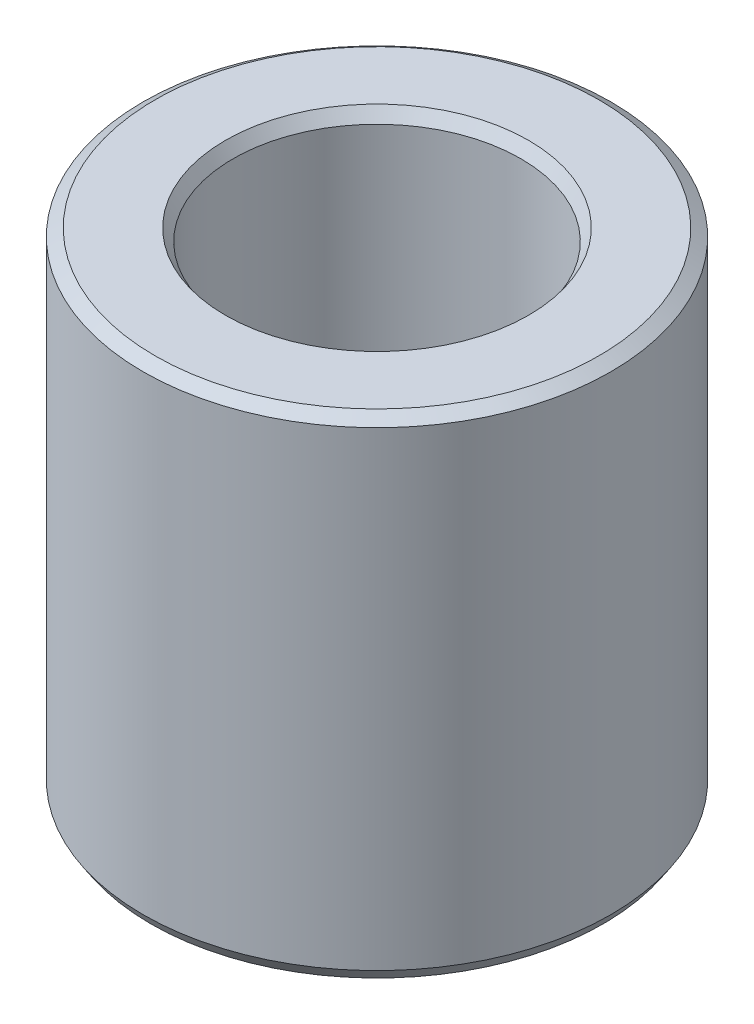
ISO-10303-21;
HEADER;
FILE_DESCRIPTION(('STEP AP214'),'2;1');
FILE_NAME('part.step','',(''),(''),'','','');
FILE_SCHEMA(('AUTOMOTIVE_DESIGN { 1 0 10303 214 1 1 1 1 }'));
ENDSEC;
DATA;
#1=APPLICATION_CONTEXT('core data for automotive mechanical design processes');
#2=APPLICATION_PROTOCOL_DEFINITION('international standard','automotive_design',2000,#1);
#3=PRODUCT_CONTEXT('',#1,'mechanical');
#4=PRODUCT('Part','Part','',(#3));
#5=PRODUCT_RELATED_PRODUCT_CATEGORY('part','',(#4));
#6=PRODUCT_DEFINITION_FORMATION('','',#4);
#7=PRODUCT_DEFINITION_CONTEXT('part definition',#1,'design');
#8=PRODUCT_DEFINITION('design','',#6,#7);
#9=PRODUCT_DEFINITION_SHAPE('','',#8);
#10=(LENGTH_UNIT() NAMED_UNIT(*) SI_UNIT(.MILLI.,.METRE.));
#11=(NAMED_UNIT(*) PLANE_ANGLE_UNIT() SI_UNIT($,.RADIAN.));
#12=(NAMED_UNIT(*) SI_UNIT($,.STERADIAN.) SOLID_ANGLE_UNIT());
#13=UNCERTAINTY_MEASURE_WITH_UNIT(LENGTH_MEASURE(1.E-05),#10,'distance_accuracy_value','');
#14=(GEOMETRIC_REPRESENTATION_CONTEXT(3) GLOBAL_UNCERTAINTY_ASSIGNED_CONTEXT((#13)) GLOBAL_UNIT_ASSIGNED_CONTEXT((#10,
#11,#12)) REPRESENTATION_CONTEXT('',''));
#15=CARTESIAN_POINT('',(0.,0.,0.));
#16=DIRECTION('',(0.,0.,1.));
#17=DIRECTION('',(1.,0.,0.));
#18=AXIS2_PLACEMENT_3D('',#15,#16,#17);
#19=CARTESIAN_POINT('',(0.,120.466555208747,0.));
#20=DIRECTION('',(0.,-1.,0.));
#21=DIRECTION('',(0.,0.,-1.));
#22=AXIS2_PLACEMENT_3D('',#19,#20,#21);
#23=CYLINDRICAL_SURFACE('',#22,57.5);
#24=CARTESIAN_POINT('',(0.,2.94270009944182,0.));
#25=DIRECTION('',(0.,1.,0.));
#26=DIRECTION('',(0.,0.,1.));
#27=AXIS2_PLACEMENT_3D('',#24,#25,#26);
#28=CIRCLE('',#27,57.5);
#29=CARTESIAN_POINT('',(0.,2.94270009944181,-57.5));
#30=VERTEX_POINT('',#29);
#31=EDGE_CURVE('E10',#30,#30,#28,.T.);
#32=CARTESIAN_POINT('',(0.,118.551658576168,0.));
#33=DIRECTION('',(0.,1.,0.));
#34=DIRECTION('',(0.,0.,1.));
#35=AXIS2_PLACEMENT_3D('',#32,#33,#34);
#36=CIRCLE('',#35,57.5);
#37=CARTESIAN_POINT('',(0.,118.551658576168,-57.5));
#38=VERTEX_POINT('',#37);
#39=EDGE_CURVE('E50',#38,#38,#36,.F.);
#40=CARTESIAN_POINT('',(0.,2.94270009944181,-57.5));
#41=CARTESIAN_POINT('',(0.,4.14696008357438,-57.5));
#42=CARTESIAN_POINT('',(0.,5.35122006770694,-57.5));
#43=CARTESIAN_POINT('',(0.,7.75974003597207,-57.5));
#44=CARTESIAN_POINT('',(0.,8.96400002010464,-57.5));
#45=CARTESIAN_POINT('',(0.,11.3725199883698,-57.5));
#46=CARTESIAN_POINT('',(0.,12.5767799725023,-57.5));
#47=CARTESIAN_POINT('',(0.,14.9852999407675,-57.5));
#48=CARTESIAN_POINT('',(0.,16.1895599249,-57.5));
#49=CARTESIAN_POINT('',(0.,18.5980798931652,-57.5));
#50=CARTESIAN_POINT('',(0.,19.8023398772977,-57.5));
#51=CARTESIAN_POINT('',(0.,22.2108598455629,-57.5));
#52=CARTESIAN_POINT('',(0.,23.4151198296954,-57.5));
#53=CARTESIAN_POINT('',(0.,25.8236397979606,-57.5));
#54=CARTESIAN_POINT('',(0.,27.0278997820931,-57.5));
#55=CARTESIAN_POINT('',(0.,29.4364197503583,-57.5));
#56=CARTESIAN_POINT('',(0.,30.6406797344908,-57.5));
#57=CARTESIAN_POINT('',(0.,33.049199702756,-57.5));
#58=CARTESIAN_POINT('',(0.,34.2534596868885,-57.5));
#59=CARTESIAN_POINT('',(0.,36.6619796551537,-57.5));
#60=CARTESIAN_POINT('',(0.,37.8662396392862,-57.5));
#61=CARTESIAN_POINT('',(0.,40.2747596075514,-57.5));
#62=CARTESIAN_POINT('',(0.,41.4790195916839,-57.5));
#63=CARTESIAN_POINT('',(0.,43.8875395599491,-57.5));
#64=CARTESIAN_POINT('',(0.,45.0917995440816,-57.5));
#65=CARTESIAN_POINT('',(0.,47.5003195123468,-57.5));
#66=CARTESIAN_POINT('',(0.,48.7045794964793,-57.5));
#67=CARTESIAN_POINT('',(0.,51.1130994647445,-57.5));
#68=CARTESIAN_POINT('',(0.,52.317359448877,-57.5));
#69=CARTESIAN_POINT('',(0.,54.7258794171422,-57.5));
#70=CARTESIAN_POINT('',(0.,55.9301394012747,-57.5));
#71=CARTESIAN_POINT('',(0.,58.3386593695399,-57.5));
#72=CARTESIAN_POINT('',(0.,59.5429193536724,-57.5));
#73=CARTESIAN_POINT('',(0.,61.9514393219376,-57.5));
#74=CARTESIAN_POINT('',(0.,63.1556993060701,-57.5));
#75=CARTESIAN_POINT('',(0.,65.5642192743353,-57.5));
#76=CARTESIAN_POINT('',(0.,66.7684792584678,-57.5));
#77=CARTESIAN_POINT('',(0.,69.176999226733,-57.5));
#78=CARTESIAN_POINT('',(0.,70.3812592108655,-57.5));
#79=CARTESIAN_POINT('',(0.,72.7897791791306,-57.5));
#80=CARTESIAN_POINT('',(0.,73.9940391632632,-57.5));
#81=CARTESIAN_POINT('',(0.,76.4025591315283,-57.5));
#82=CARTESIAN_POINT('',(0.,77.6068191156609,-57.5));
#83=CARTESIAN_POINT('',(0.,80.0153390839261,-57.5));
#84=CARTESIAN_POINT('',(0.,81.2195990680586,-57.5));
#85=CARTESIAN_POINT('',(0.,83.6281190363238,-57.5));
#86=CARTESIAN_POINT('',(0.,84.8323790204563,-57.5));
#87=CARTESIAN_POINT('',(0.,87.2408989887215,-57.5));
#88=CARTESIAN_POINT('',(0.,88.445158972854,-57.5));
#89=CARTESIAN_POINT('',(0.,90.8536789411192,-57.5));
#90=CARTESIAN_POINT('',(0.,92.0579389252517,-57.5));
#91=CARTESIAN_POINT('',(0.,94.4664588935169,-57.5));
#92=CARTESIAN_POINT('',(0.,95.6707188776494,-57.5));
#93=CARTESIAN_POINT('',(0.,98.0792388459146,-57.5));
#94=CARTESIAN_POINT('',(0.,99.2834988300471,-57.5));
#95=CARTESIAN_POINT('',(0.,101.692018798312,-57.5));
#96=CARTESIAN_POINT('',(0.,102.896278782445,-57.5));
#97=CARTESIAN_POINT('',(0.,105.30479875071,-57.5));
#98=CARTESIAN_POINT('',(0.,106.509058734843,-57.5));
#99=CARTESIAN_POINT('',(0.,108.917578703108,-57.5));
#100=CARTESIAN_POINT('',(0.,110.12183868724,-57.5));
#101=CARTESIAN_POINT('',(0.,112.530358655505,-57.5));
#102=CARTESIAN_POINT('',(0.,113.734618639638,-57.5));
#103=CARTESIAN_POINT('',(0.,116.143138607903,-57.5));
#104=CARTESIAN_POINT('',(0.,117.347398592036,-57.5));
#105=CARTESIAN_POINT('',(0.,118.551658576168,-57.5));
#106=B_SPLINE_CURVE_WITH_KNOTS('',3,(#40,#41,#42,#43,#44,#45,#46,#47,#48,#49,#50,#51,#52,#53,
#54,#55,#56,#57,#58,#59,#60,#61,#62,#63,#64,#65,#66,#67,#68,#69,#70,#71,#72,#73,#74,#75,#76,#77,
#78,#79,#80,#81,#82,#83,#84,#85,#86,#87,#88,#89,#90,#91,#92,#93,#94,#95,#96,#97,#98,#99,#100,
#101,#102,#103,#104,#105),.UNSPECIFIED.,.F.,.F.,(4,2,2,2,2,2,2,2,2,2,2,2,2,2,2,2,2,2,2,2,2,2,2,
2,2,2,2,2,2,2,2,2,4),(0.,3.6127799523977,7.2255599047954,10.8383398571931,14.4511198095908,
18.0638997619885,21.6766797143862,25.2894596667839,28.9022396191816,32.5150195715793,
36.127799523977,39.7405794763747,43.3533594287724,46.9661393811701,50.5789193335678,
54.1916992859655,57.8044792383632,61.4172591907609,65.0300391431586,68.6428190955563,
72.255599047954,75.8683790003517,79.4811589527494,83.0939389051471,86.7067188575448,
90.3194988099425,93.9322787623402,97.5450587147379,101.157838667136,104.770618619533,
108.383398571931,111.996178524329,115.608958476726),.UNSPECIFIED.);
#107=EDGE_CURVE('BSEAM39',#30,#38,#106,.T.);
#108=ORIENTED_EDGE('',*,*,#31,.T.);
#109=ORIENTED_EDGE('',*,*,#39,.T.);
#110=ORIENTED_EDGE('',*,*,#107,.T.);
#111=ORIENTED_EDGE('',*,*,#107,.F.);
#112=EDGE_LOOP('',(#108,#110,#109,#111));
#113=FACE_BOUND('',#112,.T.);
#114=ADVANCED_FACE('F39',(#113),#23,.T.);
#115=CARTESIAN_POINT('',(0.,120.466555208747,0.));
#116=DIRECTION('',(0.,1.,0.));
#117=DIRECTION('',(0.,0.,1.));
#118=AXIS2_PLACEMENT_3D('',#115,#116,#117);
#119=PLANE('',#118);
#120=CARTESIAN_POINT('',(0.,120.466555208747,0.));
#121=DIRECTION('',(0.,1.,0.));
#122=DIRECTION('',(0.,0.,1.));
#123=AXIS2_PLACEMENT_3D('',#120,#121,#122);
#124=CIRCLE('',#123,37.2695455267397);
#125=CARTESIAN_POINT('',(0.,120.466555208747,37.2695455267397));
#126=VERTEX_POINT('',#125);
#127=EDGE_CURVE('E58',#126,#126,#124,.F.);
#128=ORIENTED_EDGE('',*,*,#127,.T.);
#129=EDGE_LOOP('',(#128));
#130=FACE_BOUND('',#129,.T.);
#131=CARTESIAN_POINT('',(0.,120.466555208747,0.));
#132=DIRECTION('',(0.,1.,0.));
#133=DIRECTION('',(0.,0.,1.));
#134=AXIS2_PLACEMENT_3D('',#131,#132,#133);
#135=CIRCLE('',#134,54.5572999005585);
#136=CARTESIAN_POINT('',(0.,120.466555208747,54.5572999005585));
#137=VERTEX_POINT('',#136);
#138=EDGE_CURVE('E61',#137,#137,#135,.T.);
#139=ORIENTED_EDGE('',*,*,#138,.T.);
#140=EDGE_LOOP('',(#139));
#141=FACE_BOUND('',#140,.T.);
#142=ADVANCED_FACE('F88',(#130,#141),#119,.T.);
#143=CARTESIAN_POINT('',(0.,0.,0.));
#144=DIRECTION('',(0.,1.,0.));
#145=DIRECTION('',(0.,0.,1.));
#146=AXIS2_PLACEMENT_3D('',#143,#144,#145);
#147=PLANE('',#146);
#148=CARTESIAN_POINT('',(0.,0.,0.));
#149=DIRECTION('',(0.,1.,0.));
#150=DIRECTION('',(0.,0.,1.));
#151=AXIS2_PLACEMENT_3D('',#148,#149,#150);
#152=CIRCLE('',#151,38.2973489936025);
#153=CARTESIAN_POINT('',(0.,0.,-38.2973489936025));
#154=VERTEX_POINT('',#153);
#155=EDGE_CURVE('E51',#154,#154,#152,.T.);
#156=ORIENTED_EDGE('',*,*,#155,.T.);
#157=EDGE_LOOP('',(#156));
#158=FACE_BOUND('',#157,.T.);
#159=CARTESIAN_POINT('',(0.,0.,0.));
#160=DIRECTION('',(0.,1.,0.));
#161=DIRECTION('',(0.,0.,1.));
#162=AXIS2_PLACEMENT_3D('',#159,#160,#161);
#163=CIRCLE('',#162,55.5851033674212);
#164=CARTESIAN_POINT('',(0.,0.,55.5851033674212));
#165=VERTEX_POINT('',#164);
#166=EDGE_CURVE('E54',#165,#165,#163,.F.);
#167=ORIENTED_EDGE('',*,*,#166,.T.);
#168=EDGE_LOOP('',(#167));
#169=FACE_BOUND('',#168,.T.);
#170=ADVANCED_FACE('F83',(#158,#169),#147,.F.);
#171=CARTESIAN_POINT('',(0.,120.466555208747,0.));
#172=DIRECTION('',(0.,-1.,0.));
#173=DIRECTION('',(0.,0.,-1.));
#174=AXIS2_PLACEMENT_3D('',#171,#172,#173);
#175=CYLINDRICAL_SURFACE('',#174,35.3546488941609);
#176=CARTESIAN_POINT('',(0.,117.523855109305,0.));
#177=DIRECTION('',(0.,1.,0.));
#178=DIRECTION('',(0.,0.,1.));
#179=AXIS2_PLACEMENT_3D('',#176,#177,#178);
#180=CIRCLE('',#179,35.3546488941609);
#181=CARTESIAN_POINT('',(0.,117.523855109305,-35.3546488941609));
#182=VERTEX_POINT('',#181);
#183=EDGE_CURVE('E67',#182,#182,#180,.T.);
#184=CARTESIAN_POINT('',(0.,1.91489663257859,0.));
#185=DIRECTION('',(0.,1.,0.));
#186=DIRECTION('',(0.,0.,1.));
#187=AXIS2_PLACEMENT_3D('',#184,#185,#186);
#188=CIRCLE('',#187,35.3546488941609);
#189=CARTESIAN_POINT('',(0.,1.91489663257857,-35.3546488941609));
#190=VERTEX_POINT('',#189);
#191=EDGE_CURVE('E69',#190,#190,#188,.F.);
#192=CARTESIAN_POINT('',(0.,117.523855109305,-35.3546488941609));
#193=CARTESIAN_POINT('',(0.,116.319595125172,-35.3546488941609));
#194=CARTESIAN_POINT('',(0.,115.11533514104,-35.3546488941609));
#195=CARTESIAN_POINT('',(0.,112.706815172775,-35.3546488941609));
#196=CARTESIAN_POINT('',(0.,111.502555188642,-35.3546488941609));
#197=CARTESIAN_POINT('',(0.,109.094035220377,-35.3546488941609));
#198=CARTESIAN_POINT('',(0.,107.889775236244,-35.3546488941609));
#199=CARTESIAN_POINT('',(0.,105.481255267979,-35.3546488941609));
#200=CARTESIAN_POINT('',(0.,104.276995283847,-35.3546488941609));
#201=CARTESIAN_POINT('',(0.,101.868475315582,-35.3546488941609));
#202=CARTESIAN_POINT('',(0.,100.664215331449,-35.3546488941609));
#203=CARTESIAN_POINT('',(0.,98.2556953631839,-35.3546488941609));
#204=CARTESIAN_POINT('',(0.,97.0514353790513,-35.3546488941609));
#205=CARTESIAN_POINT('',(0.,94.6429154107862,-35.3546488941609));
#206=CARTESIAN_POINT('',(0.,93.4386554266536,-35.3546488941609));
#207=CARTESIAN_POINT('',(0.,91.0301354583885,-35.3546488941609));
#208=CARTESIAN_POINT('',(0.,89.8258754742559,-35.3546488941609));
#209=CARTESIAN_POINT('',(0.,87.4173555059908,-35.3546488941609));
#210=CARTESIAN_POINT('',(0.,86.2130955218582,-35.3546488941609));
#211=CARTESIAN_POINT('',(0.,83.8045755535931,-35.3546488941609));
#212=CARTESIAN_POINT('',(0.,82.6003155694605,-35.3546488941609));
#213=CARTESIAN_POINT('',(0.,80.1917956011954,-35.3546488941609));
#214=CARTESIAN_POINT('',(0.,78.9875356170628,-35.3546488941609));
#215=CARTESIAN_POINT('',(0.,76.5790156487977,-35.3546488941609));
#216=CARTESIAN_POINT('',(0.,75.3747556646651,-35.3546488941609));
#217=CARTESIAN_POINT('',(0.,72.9662356964,-35.3546488941609));
#218=CARTESIAN_POINT('',(0.,71.7619757122674,-35.3546488941609));
#219=CARTESIAN_POINT('',(0.,69.3534557440023,-35.3546488941609));
#220=CARTESIAN_POINT('',(0.,68.1491957598697,-35.3546488941609));
#221=CARTESIAN_POINT('',(0.,65.7406757916046,-35.3546488941609));
#222=CARTESIAN_POINT('',(0.,64.536415807472,-35.3546488941609));
#223=CARTESIAN_POINT('',(0.,62.1278958392069,-35.3546488941609));
#224=CARTESIAN_POINT('',(0.,60.9236358550743,-35.3546488941609));
#225=CARTESIAN_POINT('',(0.,58.5151158868092,-35.3546488941609));
#226=CARTESIAN_POINT('',(0.,57.3108559026766,-35.3546488941609));
#227=CARTESIAN_POINT('',(0.,54.9023359344115,-35.3546488941609));
#228=CARTESIAN_POINT('',(0.,53.6980759502789,-35.3546488941609));
#229=CARTESIAN_POINT('',(0.,51.2895559820138,-35.3546488941609));
#230=CARTESIAN_POINT('',(0.,50.0852959978812,-35.3546488941609));
#231=CARTESIAN_POINT('',(0.,47.6767760296161,-35.3546488941609));
#232=CARTESIAN_POINT('',(0.,46.4725160454835,-35.3546488941609));
#233=CARTESIAN_POINT('',(0.,44.0639960772184,-35.3546488941609));
#234=CARTESIAN_POINT('',(0.,42.8597360930858,-35.3546488941609));
#235=CARTESIAN_POINT('',(0.,40.4512161248207,-35.3546488941609));
#236=CARTESIAN_POINT('',(0.,39.2469561406881,-35.3546488941609));
#237=CARTESIAN_POINT('',(0.,36.838436172423,-35.3546488941609));
#238=CARTESIAN_POINT('',(0.,35.6341761882904,-35.3546488941609));
#239=CARTESIAN_POINT('',(0.,33.2256562200253,-35.3546488941609));
#240=CARTESIAN_POINT('',(0.,32.0213962358927,-35.3546488941609));
#241=CARTESIAN_POINT('',(0.,29.6128762676276,-35.3546488941609));
#242=CARTESIAN_POINT('',(0.,28.408616283495,-35.3546488941609));
#243=CARTESIAN_POINT('',(0.,26.0000963152299,-35.3546488941609));
#244=CARTESIAN_POINT('',(0.,24.7958363310973,-35.3546488941609));
#245=CARTESIAN_POINT('',(0.,22.3873163628322,-35.3546488941609));
#246=CARTESIAN_POINT('',(0.,21.1830563786996,-35.3546488941609));
#247=CARTESIAN_POINT('',(0.,18.7745364104345,-35.3546488941609));
#248=CARTESIAN_POINT('',(0.,17.5702764263019,-35.3546488941609));
#249=CARTESIAN_POINT('',(0.,15.1617564580368,-35.3546488941609));
#250=CARTESIAN_POINT('',(0.,13.9574964739042,-35.3546488941609));
#251=CARTESIAN_POINT('',(0.,11.5489765056391,-35.3546488941609));
#252=CARTESIAN_POINT('',(0.,10.3447165215065,-35.3546488941609));
#253=CARTESIAN_POINT('',(0.,7.9361965532414,-35.3546488941609));
#254=CARTESIAN_POINT('',(0.,6.73193656910884,-35.3546488941609));
#255=CARTESIAN_POINT('',(0.,4.3234166008437,-35.3546488941609));
#256=CARTESIAN_POINT('',(0.,3.11915661671114,-35.3546488941609));
#257=CARTESIAN_POINT('',(0.,1.91489663257857,-35.3546488941609));
#258=B_SPLINE_CURVE_WITH_KNOTS('',3,(#192,#193,#194,#195,#196,#197,#198,#199,#200,#201,#202,
#203,#204,#205,#206,#207,#208,#209,#210,#211,#212,#213,#214,#215,#216,#217,#218,#219,#220,#221,
#222,#223,#224,#225,#226,#227,#228,#229,#230,#231,#232,#233,#234,#235,#236,#237,#238,#239,#240,
#241,#242,#243,#244,#245,#246,#247,#248,#249,#250,#251,#252,#253,#254,#255,#256,#257),
.UNSPECIFIED.,.F.,.F.,(4,2,2,2,2,2,2,2,2,2,2,2,2,2,2,2,2,2,2,2,2,2,2,2,2,2,2,2,2,2,2,2,4),(0.,
3.6127799523977,7.2255599047954,10.8383398571931,14.4511198095908,18.0638997619885,
21.6766797143862,25.2894596667839,28.9022396191816,32.5150195715793,36.127799523977,
39.7405794763747,43.3533594287724,46.9661393811701,50.5789193335678,54.1916992859655,
57.8044792383632,61.4172591907609,65.0300391431586,68.6428190955563,72.255599047954,
75.8683790003517,79.4811589527494,83.0939389051471,86.7067188575448,90.3194988099425,
93.9322787623402,97.5450587147379,101.157838667136,104.770618619533,108.383398571931,
111.996178524329,115.608958476726),.UNSPECIFIED.);
#259=EDGE_CURVE('BSEAM71',#182,#190,#258,.T.);
#260=ORIENTED_EDGE('',*,*,#183,.T.);
#261=ORIENTED_EDGE('',*,*,#191,.T.);
#262=ORIENTED_EDGE('',*,*,#259,.T.);
#263=ORIENTED_EDGE('',*,*,#259,.F.);
#264=EDGE_LOOP('',(#260,#262,#261,#263));
#265=FACE_BOUND('',#264,.T.);
#266=ADVANCED_FACE('F71',(#265),#175,.F.);
#267=CARTESIAN_POINT('',(0.,117.523855109305,0.));
#268=DIRECTION('',(0.,1.,0.));
#269=DIRECTION('',(0.,0.,1.));
#270=AXIS2_PLACEMENT_3D('',#267,#268,#269);
#271=CONICAL_SURFACE('',#270,35.3546488941609,0.576886654057044);
#272=ORIENTED_EDGE('',*,*,#127,.F.);
#273=EDGE_LOOP('',(#272));
#274=FACE_BOUND('',#273,.T.);
#275=ORIENTED_EDGE('',*,*,#183,.F.);
#276=EDGE_LOOP('',(#275));
#277=FACE_BOUND('',#276,.T.);
#278=ADVANCED_FACE('F77',(#274,#277),#271,.F.);
#279=CARTESIAN_POINT('',(0.,0.,0.));
#280=DIRECTION('',(0.,-1.,0.));
#281=DIRECTION('',(0.,0.,-1.));
#282=AXIS2_PLACEMENT_3D('',#279,#280,#281);
#283=CONICAL_SURFACE('',#282,38.2973489936025,0.993909672737857);
#284=CARTESIAN_POINT('',(0.,1.91489663257859,-35.3546488941609));
#285=CARTESIAN_POINT('',(0.,1.89494979265589,-35.3853020201968));
#286=CARTESIAN_POINT('',(0.,1.8750029527332,-35.4159551462326));
#287=CARTESIAN_POINT('',(0.,1.83510927288781,-35.4772613983043));
#288=CARTESIAN_POINT('',(0.,1.81516243296512,-35.5079145243402));
#289=CARTESIAN_POINT('',(0.,1.77526875311973,-35.5692207764119));
#290=CARTESIAN_POINT('',(0.,1.75532191319704,-35.5998739024477));
#291=CARTESIAN_POINT('',(0.,1.71542823335165,-35.6611801545194));
#292=CARTESIAN_POINT('',(0.,1.69548139342896,-35.6918332805553));
#293=CARTESIAN_POINT('',(0.,1.65558771358357,-35.753139532627));
#294=CARTESIAN_POINT('',(0.,1.63564087366088,-35.7837926586628));
#295=CARTESIAN_POINT('',(0.,1.59574719381549,-35.8450989107345));
#296=CARTESIAN_POINT('',(0.,1.57580035389279,-35.8757520367704));
#297=CARTESIAN_POINT('',(0.,1.53590667404741,-35.9370582888421));
#298=CARTESIAN_POINT('',(0.,1.51595983412471,-35.9677114148779));
#299=CARTESIAN_POINT('',(0.,1.47606615427933,-36.0290176669496));
#300=CARTESIAN_POINT('',(0.,1.45611931435663,-36.0596707929855));
#301=CARTESIAN_POINT('',(0.,1.41622563451125,-36.1209770450572));
#302=CARTESIAN_POINT('',(0.,1.39627879458855,-36.151630171093));
#303=CARTESIAN_POINT('',(0.,1.35638511474316,-36.2129364231647));
#304=CARTESIAN_POINT('',(0.,1.33643827482047,-36.2435895492006));
#305=CARTESIAN_POINT('',(0.,1.29654459497508,-36.3048958012723));
#306=CARTESIAN_POINT('',(0.,1.27659775505239,-36.3355489273081));
#307=CARTESIAN_POINT('',(0.,1.236704075207,-36.3968551793798));
#308=CARTESIAN_POINT('',(0.,1.21675723528431,-36.4275083054157));
#309=CARTESIAN_POINT('',(0.,1.17686355543892,-36.4888145574874));
#310=CARTESIAN_POINT('',(0.,1.15691671551623,-36.5194676835232));
#311=CARTESIAN_POINT('',(0.,1.11702303567084,-36.5807739355949));
#312=CARTESIAN_POINT('',(0.,1.09707619574815,-36.6114270616308));
#313=CARTESIAN_POINT('',(0.,1.05718251590276,-36.6727333137025));
#314=CARTESIAN_POINT('',(0.,1.03723567598007,-36.7033864397383));
#315=CARTESIAN_POINT('',(0.,0.99734199613468,-36.76469269181));
#316=CARTESIAN_POINT('',(0.,0.977395156211986,-36.7953458178459));
#317=CARTESIAN_POINT('',(0.,0.937501476366599,-36.8566520699176));
#318=CARTESIAN_POINT('',(0.,0.917554636443906,-36.8873051959534));
#319=CARTESIAN_POINT('',(0.,0.877660956598518,-36.9486114480251));
#320=CARTESIAN_POINT('',(0.,0.857714116675824,-36.979264574061));
#321=CARTESIAN_POINT('',(0.,0.817820436830437,-37.0405708261327));
#322=CARTESIAN_POINT('',(0.,0.797873596907744,-37.0712239521685));
#323=CARTESIAN_POINT('',(0.,0.757979917062357,-37.1325302042402));
#324=CARTESIAN_POINT('',(0.,0.738033077139663,-37.1631833302761));
#325=CARTESIAN_POINT('',(0.,0.698139397294276,-37.2244895823478));
#326=CARTESIAN_POINT('',(0.,0.678192557371582,-37.2551427083836));
#327=CARTESIAN_POINT('',(0.,0.638298877526195,-37.3164489604553));
#328=CARTESIAN_POINT('',(0.,0.618352037603502,-37.3471020864912));
#329=CARTESIAN_POINT('',(0.,0.578458357758114,-37.4084083385629));
#330=CARTESIAN_POINT('',(0.,0.558511517835421,-37.4390614645987));
#331=CARTESIAN_POINT('',(0.,0.518617837990033,-37.5003677166704));
#332=CARTESIAN_POINT('',(0.,0.498670998067339,-37.5310208427063));
#333=CARTESIAN_POINT('',(0.,0.458777318221953,-37.592327094778));
#334=CARTESIAN_POINT('',(0.,0.43883047829926,-37.6229802208138));
#335=CARTESIAN_POINT('',(0.,0.398936798453873,-37.6842864728855));
#336=CARTESIAN_POINT('',(0.,0.378989958531179,-37.7149395989214));
#337=CARTESIAN_POINT('',(0.,0.339096278685791,-37.7762458509931));
#338=CARTESIAN_POINT('',(0.,0.319149438763097,-37.8068989770289));
#339=CARTESIAN_POINT('',(0.,0.279255758917711,-37.8682052291006));
#340=CARTESIAN_POINT('',(0.,0.259308918995017,-37.8988583551365));
#341=CARTESIAN_POINT('',(0.,0.219415239149629,-37.9601646072082));
#342=CARTESIAN_POINT('',(0.,0.199468399226935,-37.990817733244));
#343=CARTESIAN_POINT('',(0.,0.159574719381548,-38.0521239853157));
#344=CARTESIAN_POINT('',(0.,0.139627879458856,-38.0827771113516));
#345=CARTESIAN_POINT('',(0.,0.0997341996134687,-38.1440833634233));
#346=CARTESIAN_POINT('',(0.,0.0797873596907748,-38.1747364894591));
#347=CARTESIAN_POINT('',(0.,0.0398936798453868,-38.2360427415308));
#348=CARTESIAN_POINT('',(0.,0.0199468399226929,-38.2666958675667));
#349=CARTESIAN_POINT('',(0.,0.,-38.2973489936025));
#350=B_SPLINE_CURVE_WITH_KNOTS('',3,(#284,#285,#286,#287,#288,#289,#290,#291,#292,#293,#294,
#295,#296,#297,#298,#299,#300,#301,#302,#303,#304,#305,#306,#307,#308,#309,#310,#311,#312,#313,
#314,#315,#316,#317,#318,#319,#320,#321,#322,#323,#324,#325,#326,#327,#328,#329,#330,#331,#332,
#333,#334,#335,#336,#337,#338,#339,#340,#341,#342,#343,#344,#345,#346,#347,#348,#349),
.UNSPECIFIED.,.F.,.F.,(4,2,2,2,2,2,2,2,2,2,2,2,2,2,2,2,2,2,2,2,2,2,2,2,2,2,2,2,2,2,2,2,4),(0.,
0.109715154049206,0.219430308098412,0.329145462147618,0.43886061619683,0.548575770246036,
0.658290924295242,0.768006078344448,0.87772123239366,0.987436386442866,1.09715154049207,
1.20686669454128,1.31658184859048,1.42629700263969,1.5360121566889,1.64572731073811,
1.75544246478731,1.86515761883652,1.97487277288573,2.08458792693494,2.19430308098414,
2.30401823503335,2.41373338908256,2.52344854313176,2.63316369718097,2.74287885123018,
2.85259400527939,2.96230915932859,3.0720243133778,3.181739467427,3.29145462147622,
3.40116977552542,3.51088492957463),.UNSPECIFIED.);
#351=EDGE_CURVE('BSEAM73',#190,#154,#350,.T.);
#352=ORIENTED_EDGE('',*,*,#191,.F.);
#353=ORIENTED_EDGE('',*,*,#155,.F.);
#354=ORIENTED_EDGE('',*,*,#351,.T.);
#355=ORIENTED_EDGE('',*,*,#351,.F.);
#356=EDGE_LOOP('',(#352,#354,#353,#355));
#357=FACE_BOUND('',#356,.T.);
#358=ADVANCED_FACE('F73',(#357),#283,.F.);
#359=CARTESIAN_POINT('',(0.,2.94270009944182,0.));
#360=DIRECTION('',(0.,1.,0.));
#361=DIRECTION('',(0.,0.,1.));
#362=AXIS2_PLACEMENT_3D('',#359,#360,#361);
#363=CONICAL_SURFACE('',#362,57.5,0.576886654057044);
#364=ORIENTED_EDGE('',*,*,#166,.F.);
#365=EDGE_LOOP('',(#364));
#366=FACE_BOUND('',#365,.T.);
#367=ORIENTED_EDGE('',*,*,#31,.F.);
#368=EDGE_LOOP('',(#367));
#369=FACE_BOUND('',#368,.T.);
#370=ADVANCED_FACE('F76',(#366,#369),#363,.T.);
#371=CARTESIAN_POINT('',(0.,120.466555208747,0.));
#372=DIRECTION('',(0.,-1.,0.));
#373=DIRECTION('',(0.,0.,-1.));
#374=AXIS2_PLACEMENT_3D('',#371,#372,#373);
#375=CONICAL_SURFACE('',#374,54.5572999005585,0.993909672737852);
#376=ORIENTED_EDGE('',*,*,#39,.F.);
#377=EDGE_LOOP('',(#376));
#378=FACE_BOUND('',#377,.T.);
#379=ORIENTED_EDGE('',*,*,#138,.F.);
#380=EDGE_LOOP('',(#379));
#381=FACE_BOUND('',#380,.T.);
#382=ADVANCED_FACE('F45',(#378,#381),#375,.T.);
#383=CLOSED_SHELL('',(#114,#142,#170,#266,#278,#358,#370,#382));
#384=MANIFOLD_SOLID_BREP('B2',#383);
#385=ADVANCED_BREP_SHAPE_REPRESENTATION('',(#18,#384),#14);
#386=SHAPE_DEFINITION_REPRESENTATION(#9,#385);
ENDSEC;
END-ISO-10303-21;
